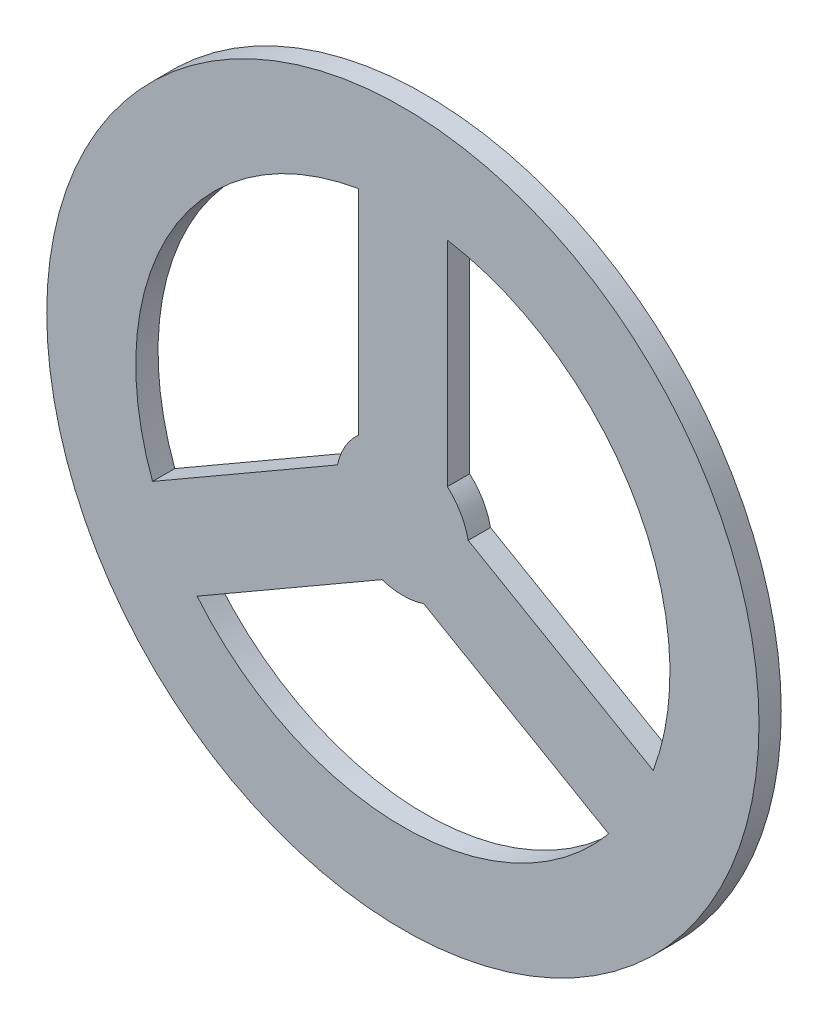
ISO-10303-21;
HEADER;
FILE_DESCRIPTION(('STEP AP214'),'2;1');
FILE_NAME('part.step','',(''),(''),'','','');
FILE_SCHEMA(('AUTOMOTIVE_DESIGN { 1 0 10303 214 1 1 1 1 }'));
ENDSEC;
DATA;
#1=APPLICATION_CONTEXT('core data for automotive mechanical design processes');
#2=APPLICATION_PROTOCOL_DEFINITION('international standard','automotive_design',2000,#1);
#3=PRODUCT_CONTEXT('',#1,'mechanical');
#4=PRODUCT('Part','Part','',(#3));
#5=PRODUCT_RELATED_PRODUCT_CATEGORY('part','',(#4));
#6=PRODUCT_DEFINITION_FORMATION('','',#4);
#7=PRODUCT_DEFINITION_CONTEXT('part definition',#1,'design');
#8=PRODUCT_DEFINITION('design','',#6,#7);
#9=PRODUCT_DEFINITION_SHAPE('','',#8);
#10=(LENGTH_UNIT() NAMED_UNIT(*) SI_UNIT(.MILLI.,.METRE.));
#11=(NAMED_UNIT(*) PLANE_ANGLE_UNIT() SI_UNIT($,.RADIAN.));
#12=(NAMED_UNIT(*) SI_UNIT($,.STERADIAN.) SOLID_ANGLE_UNIT());
#13=UNCERTAINTY_MEASURE_WITH_UNIT(LENGTH_MEASURE(1.E-05),#10,'distance_accuracy_value','');
#14=(GEOMETRIC_REPRESENTATION_CONTEXT(3) GLOBAL_UNCERTAINTY_ASSIGNED_CONTEXT((#13)) GLOBAL_UNIT_ASSIGNED_CONTEXT((#10,
#11,#12)) REPRESENTATION_CONTEXT('',''));
#15=CARTESIAN_POINT('',(0.,0.,0.));
#16=DIRECTION('',(0.,0.,1.));
#17=DIRECTION('',(1.,0.,0.));
#18=AXIS2_PLACEMENT_3D('',#15,#16,#17);
#19=CARTESIAN_POINT('',(0.,0.,4.445));
#20=DIRECTION('',(0.,0.,1.));
#21=DIRECTION('',(1.,0.,0.));
#22=AXIS2_PLACEMENT_3D('',#19,#20,#21);
#23=PLANE('',#22);
#24=CARTESIAN_POINT('',(0.,0.,4.445));
#25=DIRECTION('',(0.,0.,1.));
#26=DIRECTION('',(1.,0.,0.));
#27=AXIS2_PLACEMENT_3D('',#24,#25,#26);
#28=CIRCLE('',#27,40.64);
#29=CARTESIAN_POINT('',(40.64,0.,4.445));
#30=VERTEX_POINT('',#29);
#31=EDGE_CURVE('E11',#30,#30,#28,.T.);
#32=ORIENTED_EDGE('',*,*,#31,.T.);
#33=EDGE_LOOP('',(#32));
#34=FACE_BOUND('',#33,.T.);
#35=DIRECTION('',(0.866025403784436,-0.500000000000004,0.));
#36=VECTOR('',#35,1.);
#37=CARTESIAN_POINT('',(7.45868884968341,1.55960271980019,4.445));
#38=LINE('',#37,#36);
#39=CARTESIAN_POINT('',(7.45868884968341,1.55960271980019,4.445));
#40=VERTEX_POINT('',#39);
#41=CARTESIAN_POINT('',(28.5672549455373,-10.6274335978482,4.445));
#42=VERTEX_POINT('',#41);
#43=EDGE_CURVE('E197',#40,#42,#38,.T.);
#44=ORIENTED_EDGE('',*,*,#43,.F.);
#45=CARTESIAN_POINT('',(0.,0.,4.445));
#46=DIRECTION('',(0.,0.,-1.));
#47=DIRECTION('',(1.,0.,0.));
#48=AXIS2_PLACEMENT_3D('',#45,#46,#47);
#49=CIRCLE('',#48,7.62);
#50=CARTESIAN_POINT('',(5.07999999999998,5.67961266284948,4.445));
#51=VERTEX_POINT('',#50);
#52=EDGE_CURVE('E195',#51,#40,#49,.T.);
#53=ORIENTED_EDGE('',*,*,#52,.F.);
#54=DIRECTION('',(0.,-1.,0.));
#55=VECTOR('',#54,1.);
#56=CARTESIAN_POINT('',(5.07999999999998,5.67961266284948,4.445));
#57=LINE('',#56,#55);
#58=CARTESIAN_POINT('',(5.07999999999998,30.0536852981461,4.445));
#59=VERTEX_POINT('',#58);
#60=EDGE_CURVE('E203',#59,#51,#57,.T.);
#61=ORIENTED_EDGE('',*,*,#60,.F.);
#62=CARTESIAN_POINT('',(0.,0.,4.445));
#63=DIRECTION('',(0.,0.,1.));
#64=DIRECTION('',(1.,0.,0.));
#65=AXIS2_PLACEMENT_3D('',#62,#63,#64);
#66=CIRCLE('',#65,30.48);
#67=EDGE_CURVE('E200',#42,#59,#66,.T.);
#68=ORIENTED_EDGE('',*,*,#67,.F.);
#69=EDGE_LOOP('',(#44,#53,#61,#68));
#70=FACE_BOUND('',#69,.T.);
#71=DIRECTION('',(0.,1.,0.));
#72=VECTOR('',#71,1.);
#73=CARTESIAN_POINT('',(-5.08000000000002,5.67961266284948,4.445));
#74=LINE('',#73,#72);
#75=CARTESIAN_POINT('',(-5.08000000000002,5.67961266284948,4.445));
#76=VERTEX_POINT('',#75);
#77=CARTESIAN_POINT('',(-5.08000000000002,30.0536852981461,4.445));
#78=VERTEX_POINT('',#77);
#79=EDGE_CURVE('E166',#76,#78,#74,.T.);
#80=ORIENTED_EDGE('',*,*,#79,.F.);
#81=CARTESIAN_POINT('',(0.,0.,4.445));
#82=DIRECTION('',(0.,0.,-1.));
#83=DIRECTION('',(1.,0.,0.));
#84=AXIS2_PLACEMENT_3D('',#81,#82,#83);
#85=CIRCLE('',#84,7.62);
#86=CARTESIAN_POINT('',(-7.45868884968342,1.55960271980029,4.445));
#87=VERTEX_POINT('',#86);
#88=EDGE_CURVE('E164',#87,#76,#85,.T.);
#89=ORIENTED_EDGE('',*,*,#88,.F.);
#90=DIRECTION('',(0.866025403784443,0.499999999999992,0.));
#91=VECTOR('',#90,1.);
#92=CARTESIAN_POINT('',(-7.45868884968342,1.55960271980029,4.445));
#93=LINE('',#92,#91);
#94=CARTESIAN_POINT('',(-28.5672549455375,-10.6274335978478,4.445));
#95=VERTEX_POINT('',#94);
#96=EDGE_CURVE('E172',#95,#87,#93,.T.);
#97=ORIENTED_EDGE('',*,*,#96,.F.);
#98=CARTESIAN_POINT('',(0.,0.,4.445));
#99=DIRECTION('',(0.,0.,1.));
#100=DIRECTION('',(1.,0.,0.));
#101=AXIS2_PLACEMENT_3D('',#98,#99,#100);
#102=CIRCLE('',#101,30.48);
#103=EDGE_CURVE('E169',#78,#95,#102,.T.);
#104=ORIENTED_EDGE('',*,*,#103,.F.);
#105=EDGE_LOOP('',(#80,#89,#97,#104));
#106=FACE_BOUND('',#105,.T.);
#107=DIRECTION('',(-0.866025403784443,-0.499999999999992,0.));
#108=VECTOR('',#107,1.);
#109=CARTESIAN_POINT('',(-2.3786888496835,-7.23921538264965,4.445));
#110=LINE('',#109,#108);
#111=CARTESIAN_POINT('',(-2.3786888496835,-7.23921538264965,4.445));
#112=VERTEX_POINT('',#111);
#113=CARTESIAN_POINT('',(-23.4872549455376,-19.4262517002977,4.445));
#114=VERTEX_POINT('',#113);
#115=EDGE_CURVE('E136',#112,#114,#110,.T.);
#116=ORIENTED_EDGE('',*,*,#115,.F.);
#117=CARTESIAN_POINT('',(0.,0.,4.445));
#118=DIRECTION('',(0.,0.,-1.));
#119=DIRECTION('',(1.,0.,0.));
#120=AXIS2_PLACEMENT_3D('',#117,#118,#119);
#121=CIRCLE('',#120,7.62);
#122=CARTESIAN_POINT('',(2.37868884968337,-7.23921538264969,4.445));
#123=VERTEX_POINT('',#122);
#124=EDGE_CURVE('E128',#123,#112,#121,.T.);
#125=ORIENTED_EDGE('',*,*,#124,.F.);
#126=DIRECTION('',(-0.866025403784436,0.500000000000004,0.));
#127=VECTOR('',#126,1.);
#128=CARTESIAN_POINT('',(2.37868884968337,-7.23921538264969,4.445));
#129=LINE('',#128,#127);
#130=CARTESIAN_POINT('',(23.4872549455373,-19.4262517002981,4.445));
#131=VERTEX_POINT('',#130);
#132=EDGE_CURVE('E150',#131,#123,#129,.T.);
#133=ORIENTED_EDGE('',*,*,#132,.F.);
#134=CARTESIAN_POINT('',(0.,0.,4.445));
#135=DIRECTION('',(0.,0.,1.));
#136=DIRECTION('',(1.,0.,0.));
#137=AXIS2_PLACEMENT_3D('',#134,#135,#136);
#138=CIRCLE('',#137,30.48);
#139=EDGE_CURVE('E148',#114,#131,#138,.T.);
#140=ORIENTED_EDGE('',*,*,#139,.F.);
#141=EDGE_LOOP('',(#116,#125,#133,#140));
#142=FACE_BOUND('',#141,.T.);
#143=ADVANCED_FACE('F39',(#34,#70,#106,#142),#23,.T.);
#144=CARTESIAN_POINT('',(0.,0.,1.905));
#145=DIRECTION('',(0.,0.,1.));
#146=DIRECTION('',(1.,0.,0.));
#147=AXIS2_PLACEMENT_3D('',#144,#145,#146);
#148=PLANE('',#147);
#149=CARTESIAN_POINT('',(0.,0.,1.905));
#150=DIRECTION('',(0.,0.,-1.));
#151=DIRECTION('',(1.,0.,0.));
#152=AXIS2_PLACEMENT_3D('',#149,#150,#151);
#153=CIRCLE('',#152,7.62);
#154=CARTESIAN_POINT('',(-7.45868884968342,1.55960271980029,1.905));
#155=VERTEX_POINT('',#154);
#156=CARTESIAN_POINT('',(-5.08000000000002,5.67961266284948,1.905));
#157=VERTEX_POINT('',#156);
#158=EDGE_CURVE('E144',#155,#157,#153,.T.);
#159=ORIENTED_EDGE('',*,*,#158,.T.);
#160=DIRECTION('',(0.,1.,0.));
#161=VECTOR('',#160,1.);
#162=CARTESIAN_POINT('',(-5.08000000000002,5.67961266284948,1.905));
#163=LINE('',#162,#161);
#164=CARTESIAN_POINT('',(-5.08000000000002,30.0536852981461,1.905));
#165=VERTEX_POINT('',#164);
#166=EDGE_CURVE('E177',#157,#165,#163,.T.);
#167=ORIENTED_EDGE('',*,*,#166,.T.);
#168=CARTESIAN_POINT('',(0.,0.,1.905));
#169=DIRECTION('',(0.,0.,1.));
#170=DIRECTION('',(1.,0.,0.));
#171=AXIS2_PLACEMENT_3D('',#168,#169,#170);
#172=CIRCLE('',#171,30.48);
#173=CARTESIAN_POINT('',(-28.5672549455375,-10.6274335978478,1.905));
#174=VERTEX_POINT('',#173);
#175=EDGE_CURVE('E180',#165,#174,#172,.T.);
#176=ORIENTED_EDGE('',*,*,#175,.T.);
#177=DIRECTION('',(0.866025403784443,0.499999999999992,0.));
#178=VECTOR('',#177,1.);
#179=CARTESIAN_POINT('',(-7.45868884968342,1.55960271980029,1.905));
#180=LINE('',#179,#178);
#181=EDGE_CURVE('E167',#174,#155,#180,.T.);
#182=ORIENTED_EDGE('',*,*,#181,.T.);
#183=EDGE_LOOP('',(#159,#167,#176,#182));
#184=FACE_BOUND('',#183,.T.);
#185=CARTESIAN_POINT('',(0.,0.,1.905));
#186=DIRECTION('',(0.,0.,1.));
#187=DIRECTION('',(1.,0.,0.));
#188=AXIS2_PLACEMENT_3D('',#185,#186,#187);
#189=CIRCLE('',#188,40.64);
#190=CARTESIAN_POINT('',(40.64,0.,1.905));
#191=VERTEX_POINT('',#190);
#192=EDGE_CURVE('E43',#191,#191,#189,.T.);
#193=ORIENTED_EDGE('',*,*,#192,.F.);
#194=EDGE_LOOP('',(#193));
#195=FACE_BOUND('',#194,.T.);
#196=CARTESIAN_POINT('',(0.,0.,1.905));
#197=DIRECTION('',(0.,0.,-1.));
#198=DIRECTION('',(1.,0.,0.));
#199=AXIS2_PLACEMENT_3D('',#196,#197,#198);
#200=CIRCLE('',#199,7.62);
#201=CARTESIAN_POINT('',(5.07999999999998,5.67961266284948,1.905));
#202=VERTEX_POINT('',#201);
#203=CARTESIAN_POINT('',(7.45868884968341,1.55960271980019,1.905));
#204=VERTEX_POINT('',#203);
#205=EDGE_CURVE('E194',#202,#204,#200,.T.);
#206=ORIENTED_EDGE('',*,*,#205,.T.);
#207=DIRECTION('',(0.866025403784436,-0.500000000000004,0.));
#208=VECTOR('',#207,1.);
#209=CARTESIAN_POINT('',(7.45868884968341,1.55960271980019,1.905));
#210=LINE('',#209,#208);
#211=CARTESIAN_POINT('',(28.5672549455373,-10.6274335978482,1.905));
#212=VERTEX_POINT('',#211);
#213=EDGE_CURVE('E208',#204,#212,#210,.T.);
#214=ORIENTED_EDGE('',*,*,#213,.T.);
#215=CARTESIAN_POINT('',(0.,0.,1.905));
#216=DIRECTION('',(0.,0.,1.));
#217=DIRECTION('',(1.,0.,0.));
#218=AXIS2_PLACEMENT_3D('',#215,#216,#217);
#219=CIRCLE('',#218,30.48);
#220=CARTESIAN_POINT('',(5.07999999999998,30.0536852981461,1.905));
#221=VERTEX_POINT('',#220);
#222=EDGE_CURVE('E211',#212,#221,#219,.T.);
#223=ORIENTED_EDGE('',*,*,#222,.T.);
#224=DIRECTION('',(0.,-1.,0.));
#225=VECTOR('',#224,1.);
#226=CARTESIAN_POINT('',(5.07999999999998,5.67961266284948,1.905));
#227=LINE('',#226,#225);
#228=EDGE_CURVE('E198',#221,#202,#227,.T.);
#229=ORIENTED_EDGE('',*,*,#228,.T.);
#230=EDGE_LOOP('',(#206,#214,#223,#229));
#231=FACE_BOUND('',#230,.T.);
#232=CARTESIAN_POINT('',(0.,0.,1.905));
#233=DIRECTION('',(0.,0.,-1.));
#234=DIRECTION('',(1.,0.,0.));
#235=AXIS2_PLACEMENT_3D('',#232,#233,#234);
#236=CIRCLE('',#235,7.62);
#237=CARTESIAN_POINT('',(2.37868884968337,-7.23921538264969,1.905));
#238=VERTEX_POINT('',#237);
#239=CARTESIAN_POINT('',(-2.3786888496835,-7.23921538264965,1.905));
#240=VERTEX_POINT('',#239);
#241=EDGE_CURVE('E62',#238,#240,#236,.T.);
#242=ORIENTED_EDGE('',*,*,#241,.T.);
#243=DIRECTION('',(-0.866025403784443,-0.499999999999992,0.));
#244=VECTOR('',#243,1.);
#245=CARTESIAN_POINT('',(-2.3786888496835,-7.23921538264965,1.905));
#246=LINE('',#245,#244);
#247=CARTESIAN_POINT('',(-23.4872549455376,-19.4262517002977,1.905));
#248=VERTEX_POINT('',#247);
#249=EDGE_CURVE('E143',#240,#248,#246,.T.);
#250=ORIENTED_EDGE('',*,*,#249,.T.);
#251=CARTESIAN_POINT('',(0.,0.,1.905));
#252=DIRECTION('',(0.,0.,1.));
#253=DIRECTION('',(1.,0.,0.));
#254=AXIS2_PLACEMENT_3D('',#251,#252,#253);
#255=CIRCLE('',#254,30.48);
#256=CARTESIAN_POINT('',(23.4872549455373,-19.4262517002981,1.905));
#257=VERTEX_POINT('',#256);
#258=EDGE_CURVE('E156',#248,#257,#255,.T.);
#259=ORIENTED_EDGE('',*,*,#258,.T.);
#260=DIRECTION('',(-0.866025403784436,0.500000000000004,0.));
#261=VECTOR('',#260,1.);
#262=CARTESIAN_POINT('',(2.37868884968337,-7.23921538264969,1.905));
#263=LINE('',#262,#261);
#264=EDGE_CURVE('E137',#257,#238,#263,.T.);
#265=ORIENTED_EDGE('',*,*,#264,.T.);
#266=EDGE_LOOP('',(#242,#250,#259,#265));
#267=FACE_BOUND('',#266,.T.);
#268=ADVANCED_FACE('F230',(#184,#195,#231,#267),#148,.F.);
#269=CARTESIAN_POINT('',(0.,0.,4.445));
#270=DIRECTION('',(0.,0.,-1.));
#271=DIRECTION('',(-1.,0.,0.));
#272=AXIS2_PLACEMENT_3D('',#269,#270,#271);
#273=CYLINDRICAL_SURFACE('',#272,40.64);
#274=ORIENTED_EDGE('',*,*,#31,.F.);
#275=EDGE_LOOP('',(#274));
#276=FACE_BOUND('',#275,.T.);
#277=ORIENTED_EDGE('',*,*,#192,.T.);
#278=EDGE_LOOP('',(#277));
#279=FACE_BOUND('',#278,.T.);
#280=ADVANCED_FACE('F41',(#276,#279),#273,.T.);
#281=CARTESIAN_POINT('',(0.,0.,4.445));
#282=DIRECTION('',(0.,0.,-1.));
#283=DIRECTION('',(-1.,0.,0.));
#284=AXIS2_PLACEMENT_3D('',#281,#282,#283);
#285=CYLINDRICAL_SURFACE('',#284,7.62);
#286=ORIENTED_EDGE('',*,*,#205,.F.);
#287=DIRECTION('',(0.,0.,-1.));
#288=VECTOR('',#287,1.);
#289=CARTESIAN_POINT('',(5.07999999999998,5.67961266284948,4.445));
#290=LINE('',#289,#288);
#291=EDGE_CURVE('E205',#51,#202,#290,.T.);
#292=ORIENTED_EDGE('',*,*,#291,.F.);
#293=ORIENTED_EDGE('',*,*,#52,.T.);
#294=DIRECTION('',(0.,0.,-1.));
#295=VECTOR('',#294,1.);
#296=CARTESIAN_POINT('',(7.45868884968341,1.55960271980019,4.445));
#297=LINE('',#296,#295);
#298=EDGE_CURVE('E222',#40,#204,#297,.T.);
#299=ORIENTED_EDGE('',*,*,#298,.T.);
#300=EDGE_LOOP('',(#286,#292,#293,#299));
#301=FACE_BOUND('',#300,.T.);
#302=ADVANCED_FACE('F252',(#301),#285,.T.);
#303=CARTESIAN_POINT('',(7.45868884968341,1.55960271980019,4.445));
#304=DIRECTION('',(0.500000000000004,0.866025403784436,0.));
#305=DIRECTION('',(-0.866025403784436,0.500000000000004,0.));
#306=AXIS2_PLACEMENT_3D('',#303,#304,#305);
#307=PLANE('',#306);
#308=ORIENTED_EDGE('',*,*,#213,.F.);
#309=ORIENTED_EDGE('',*,*,#298,.F.);
#310=ORIENTED_EDGE('',*,*,#43,.T.);
#311=DIRECTION('',(0.,0.,-1.));
#312=VECTOR('',#311,1.);
#313=CARTESIAN_POINT('',(28.5672549455373,-10.6274335978482,4.445));
#314=LINE('',#313,#312);
#315=EDGE_CURVE('E220',#42,#212,#314,.T.);
#316=ORIENTED_EDGE('',*,*,#315,.T.);
#317=EDGE_LOOP('',(#308,#309,#310,#316));
#318=FACE_BOUND('',#317,.T.);
#319=ADVANCED_FACE('F255',(#318),#307,.T.);
#320=CARTESIAN_POINT('',(0.,0.,4.445));
#321=DIRECTION('',(0.,0.,-1.));
#322=DIRECTION('',(-1.,0.,0.));
#323=AXIS2_PLACEMENT_3D('',#320,#321,#322);
#324=CYLINDRICAL_SURFACE('',#323,30.48);
#325=ORIENTED_EDGE('',*,*,#222,.F.);
#326=ORIENTED_EDGE('',*,*,#315,.F.);
#327=ORIENTED_EDGE('',*,*,#67,.T.);
#328=DIRECTION('',(0.,0.,-1.));
#329=VECTOR('',#328,1.);
#330=CARTESIAN_POINT('',(5.07999999999998,30.0536852981461,4.445));
#331=LINE('',#330,#329);
#332=EDGE_CURVE('E218',#59,#221,#331,.T.);
#333=ORIENTED_EDGE('',*,*,#332,.T.);
#334=EDGE_LOOP('',(#325,#326,#327,#333));
#335=FACE_BOUND('',#334,.T.);
#336=ADVANCED_FACE('F258',(#335),#324,.F.);
#337=CARTESIAN_POINT('',(5.07999999999998,5.67961266284948,4.445));
#338=DIRECTION('',(1.,0.,0.));
#339=DIRECTION('',(0.,0.,-1.));
#340=AXIS2_PLACEMENT_3D('',#337,#338,#339);
#341=PLANE('',#340);
#342=ORIENTED_EDGE('',*,*,#228,.F.);
#343=ORIENTED_EDGE('',*,*,#332,.F.);
#344=ORIENTED_EDGE('',*,*,#60,.T.);
#345=ORIENTED_EDGE('',*,*,#291,.T.);
#346=EDGE_LOOP('',(#342,#343,#344,#345));
#347=FACE_BOUND('',#346,.T.);
#348=ADVANCED_FACE('F262',(#347),#341,.T.);
#349=CARTESIAN_POINT('',(0.,0.,4.445));
#350=DIRECTION('',(0.,0.,-1.));
#351=DIRECTION('',(-1.,0.,0.));
#352=AXIS2_PLACEMENT_3D('',#349,#350,#351);
#353=CYLINDRICAL_SURFACE('',#352,7.62);
#354=ORIENTED_EDGE('',*,*,#158,.F.);
#355=DIRECTION('',(0.,0.,-1.));
#356=VECTOR('',#355,1.);
#357=CARTESIAN_POINT('',(-7.45868884968342,1.55960271980029,4.445));
#358=LINE('',#357,#356);
#359=EDGE_CURVE('E174',#87,#155,#358,.T.);
#360=ORIENTED_EDGE('',*,*,#359,.F.);
#361=ORIENTED_EDGE('',*,*,#88,.T.);
#362=DIRECTION('',(0.,0.,-1.));
#363=VECTOR('',#362,1.);
#364=CARTESIAN_POINT('',(-5.08000000000002,5.67961266284948,4.445));
#365=LINE('',#364,#363);
#366=EDGE_CURVE('E191',#76,#157,#365,.T.);
#367=ORIENTED_EDGE('',*,*,#366,.T.);
#368=EDGE_LOOP('',(#354,#360,#361,#367));
#369=FACE_BOUND('',#368,.T.);
#370=ADVANCED_FACE('F266',(#369),#353,.T.);
#371=CARTESIAN_POINT('',(-5.08000000000002,5.67961266284948,4.445));
#372=DIRECTION('',(-1.,0.,0.));
#373=DIRECTION('',(0.,0.,1.));
#374=AXIS2_PLACEMENT_3D('',#371,#372,#373);
#375=PLANE('',#374);
#376=ORIENTED_EDGE('',*,*,#166,.F.);
#377=ORIENTED_EDGE('',*,*,#366,.F.);
#378=ORIENTED_EDGE('',*,*,#79,.T.);
#379=DIRECTION('',(0.,0.,-1.));
#380=VECTOR('',#379,1.);
#381=CARTESIAN_POINT('',(-5.08000000000002,30.0536852981461,4.445));
#382=LINE('',#381,#380);
#383=EDGE_CURVE('E189',#78,#165,#382,.T.);
#384=ORIENTED_EDGE('',*,*,#383,.T.);
#385=EDGE_LOOP('',(#376,#377,#378,#384));
#386=FACE_BOUND('',#385,.T.);
#387=ADVANCED_FACE('F270',(#386),#375,.T.);
#388=CARTESIAN_POINT('',(0.,0.,4.445));
#389=DIRECTION('',(0.,0.,-1.));
#390=DIRECTION('',(-1.,0.,0.));
#391=AXIS2_PLACEMENT_3D('',#388,#389,#390);
#392=CYLINDRICAL_SURFACE('',#391,30.48);
#393=ORIENTED_EDGE('',*,*,#175,.F.);
#394=ORIENTED_EDGE('',*,*,#383,.F.);
#395=ORIENTED_EDGE('',*,*,#103,.T.);
#396=DIRECTION('',(0.,0.,-1.));
#397=VECTOR('',#396,1.);
#398=CARTESIAN_POINT('',(-28.5672549455375,-10.6274335978478,4.445));
#399=LINE('',#398,#397);
#400=EDGE_CURVE('E187',#95,#174,#399,.T.);
#401=ORIENTED_EDGE('',*,*,#400,.T.);
#402=EDGE_LOOP('',(#393,#394,#395,#401));
#403=FACE_BOUND('',#402,.T.);
#404=ADVANCED_FACE('F274',(#403),#392,.F.);
#405=CARTESIAN_POINT('',(-7.45868884968342,1.55960271980029,4.445));
#406=DIRECTION('',(-0.499999999999992,0.866025403784443,0.));
#407=DIRECTION('',(-0.866025403784443,-0.499999999999992,0.));
#408=AXIS2_PLACEMENT_3D('',#405,#406,#407);
#409=PLANE('',#408);
#410=ORIENTED_EDGE('',*,*,#181,.F.);
#411=ORIENTED_EDGE('',*,*,#400,.F.);
#412=ORIENTED_EDGE('',*,*,#96,.T.);
#413=ORIENTED_EDGE('',*,*,#359,.T.);
#414=EDGE_LOOP('',(#410,#411,#412,#413));
#415=FACE_BOUND('',#414,.T.);
#416=ADVANCED_FACE('F278',(#415),#409,.T.);
#417=CARTESIAN_POINT('',(0.,0.,4.445));
#418=DIRECTION('',(0.,0.,-1.));
#419=DIRECTION('',(-1.,0.,0.));
#420=AXIS2_PLACEMENT_3D('',#417,#418,#419);
#421=CYLINDRICAL_SURFACE('',#420,7.62);
#422=ORIENTED_EDGE('',*,*,#241,.F.);
#423=DIRECTION('',(0.,0.,-1.));
#424=VECTOR('',#423,1.);
#425=CARTESIAN_POINT('',(2.37868884968337,-7.23921538264969,4.445));
#426=LINE('',#425,#424);
#427=EDGE_CURVE('E132',#123,#238,#426,.T.);
#428=ORIENTED_EDGE('',*,*,#427,.F.);
#429=ORIENTED_EDGE('',*,*,#124,.T.);
#430=DIRECTION('',(0.,0.,-1.));
#431=VECTOR('',#430,1.);
#432=CARTESIAN_POINT('',(-2.3786888496835,-7.23921538264965,4.445));
#433=LINE('',#432,#431);
#434=EDGE_CURVE('E131',#112,#240,#433,.T.);
#435=ORIENTED_EDGE('',*,*,#434,.T.);
#436=EDGE_LOOP('',(#422,#428,#429,#435));
#437=FACE_BOUND('',#436,.T.);
#438=ADVANCED_FACE('F130',(#437),#421,.T.);
#439=CARTESIAN_POINT('',(-2.3786888496835,-7.23921538264965,4.445));
#440=DIRECTION('',(0.499999999999992,-0.866025403784443,0.));
#441=DIRECTION('',(0.866025403784443,0.499999999999992,0.));
#442=AXIS2_PLACEMENT_3D('',#439,#440,#441);
#443=PLANE('',#442);
#444=ORIENTED_EDGE('',*,*,#249,.F.);
#445=ORIENTED_EDGE('',*,*,#434,.F.);
#446=ORIENTED_EDGE('',*,*,#115,.T.);
#447=DIRECTION('',(0.,0.,-1.));
#448=VECTOR('',#447,1.);
#449=CARTESIAN_POINT('',(-23.4872549455376,-19.4262517002977,4.445));
#450=LINE('',#449,#448);
#451=EDGE_CURVE('E145',#114,#248,#450,.T.);
#452=ORIENTED_EDGE('',*,*,#451,.T.);
#453=EDGE_LOOP('',(#444,#445,#446,#452));
#454=FACE_BOUND('',#453,.T.);
#455=ADVANCED_FACE('F140',(#454),#443,.T.);
#456=CARTESIAN_POINT('',(0.,0.,4.445));
#457=DIRECTION('',(0.,0.,-1.));
#458=DIRECTION('',(-1.,0.,0.));
#459=AXIS2_PLACEMENT_3D('',#456,#457,#458);
#460=CYLINDRICAL_SURFACE('',#459,30.48);
#461=ORIENTED_EDGE('',*,*,#258,.F.);
#462=ORIENTED_EDGE('',*,*,#451,.F.);
#463=ORIENTED_EDGE('',*,*,#139,.T.);
#464=DIRECTION('',(0.,0.,-1.));
#465=VECTOR('',#464,1.);
#466=CARTESIAN_POINT('',(23.4872549455373,-19.4262517002981,4.445));
#467=LINE('',#466,#465);
#468=EDGE_CURVE('E54',#131,#257,#467,.T.);
#469=ORIENTED_EDGE('',*,*,#468,.T.);
#470=EDGE_LOOP('',(#461,#462,#463,#469));
#471=FACE_BOUND('',#470,.T.);
#472=ADVANCED_FACE('F238',(#471),#460,.F.);
#473=CARTESIAN_POINT('',(2.37868884968337,-7.23921538264969,4.445));
#474=DIRECTION('',(-0.500000000000004,-0.866025403784436,0.));
#475=DIRECTION('',(0.866025403784436,-0.500000000000004,0.));
#476=AXIS2_PLACEMENT_3D('',#473,#474,#475);
#477=PLANE('',#476);
#478=ORIENTED_EDGE('',*,*,#264,.F.);
#479=ORIENTED_EDGE('',*,*,#468,.F.);
#480=ORIENTED_EDGE('',*,*,#132,.T.);
#481=ORIENTED_EDGE('',*,*,#427,.T.);
#482=EDGE_LOOP('',(#478,#479,#480,#481));
#483=FACE_BOUND('',#482,.T.);
#484=ADVANCED_FACE('F236',(#483),#477,.T.);
#485=CLOSED_SHELL('',(#143,#268,#280,#302,#319,#336,#348,#370,#387,#404,#416,#438,#455,#472,#484));
#486=MANIFOLD_SOLID_BREP('B2',#485);
#487=ADVANCED_BREP_SHAPE_REPRESENTATION('',(#18,#486),#14);
#488=SHAPE_DEFINITION_REPRESENTATION(#9,#487);
ENDSEC;
END-ISO-10303-21;
